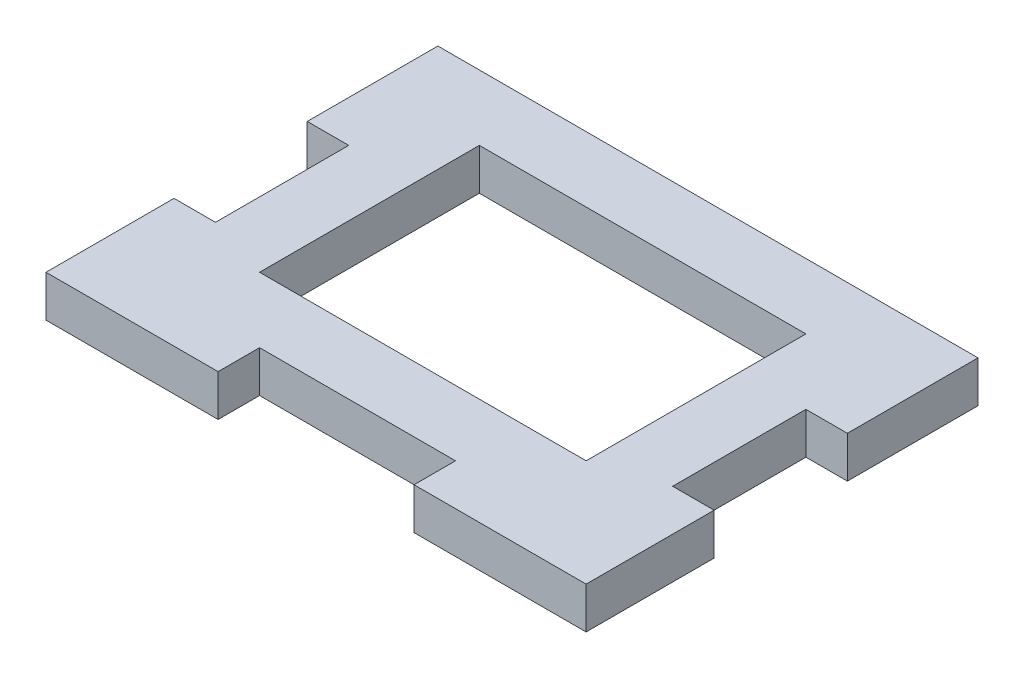
ISO-10303-21;
HEADER;
FILE_DESCRIPTION(('STEP AP214'),'2;1');
FILE_NAME('part.step','',(''),(''),'','','');
FILE_SCHEMA(('AUTOMOTIVE_DESIGN { 1 0 10303 214 1 1 1 1 }'));
ENDSEC;
DATA;
#1=APPLICATION_CONTEXT('core data for automotive mechanical design processes');
#2=APPLICATION_PROTOCOL_DEFINITION('international standard','automotive_design',2000,#1);
#3=PRODUCT_CONTEXT('',#1,'mechanical');
#4=PRODUCT('Part','Part','',(#3));
#5=PRODUCT_RELATED_PRODUCT_CATEGORY('part','',(#4));
#6=PRODUCT_DEFINITION_FORMATION('','',#4);
#7=PRODUCT_DEFINITION_CONTEXT('part definition',#1,'design');
#8=PRODUCT_DEFINITION('design','',#6,#7);
#9=PRODUCT_DEFINITION_SHAPE('','',#8);
#10=(LENGTH_UNIT() NAMED_UNIT(*) SI_UNIT(.MILLI.,.METRE.));
#11=(NAMED_UNIT(*) PLANE_ANGLE_UNIT() SI_UNIT($,.RADIAN.));
#12=(NAMED_UNIT(*) SI_UNIT($,.STERADIAN.) SOLID_ANGLE_UNIT());
#13=UNCERTAINTY_MEASURE_WITH_UNIT(LENGTH_MEASURE(1.E-05),#10,'distance_accuracy_value','');
#14=(GEOMETRIC_REPRESENTATION_CONTEXT(3) GLOBAL_UNCERTAINTY_ASSIGNED_CONTEXT((#13)) GLOBAL_UNIT_ASSIGNED_CONTEXT((#10,
#11,#12)) REPRESENTATION_CONTEXT('',''));
#15=CARTESIAN_POINT('',(0.,0.,0.));
#16=DIRECTION('',(0.,0.,1.));
#17=DIRECTION('',(1.,0.,0.));
#18=AXIS2_PLACEMENT_3D('',#15,#16,#17);
#19=CARTESIAN_POINT('',(0.,3.175,0.));
#20=DIRECTION('',(0.,0.,-1.));
#21=DIRECTION('',(-1.,0.,0.));
#22=AXIS2_PLACEMENT_3D('',#19,#20,#21);
#23=PLANE('',#22);
#24=DIRECTION('',(1.,0.,0.));
#25=VECTOR('',#24,1.);
#26=CARTESIAN_POINT('',(0.,0.,0.));
#27=LINE('',#26,#25);
#28=CARTESIAN_POINT('',(0.,0.,0.));
#29=VERTEX_POINT('',#28);
#30=CARTESIAN_POINT('',(13.175,0.,0.));
#31=VERTEX_POINT('',#30);
#32=EDGE_CURVE('E306',#29,#31,#27,.T.);
#33=ORIENTED_EDGE('',*,*,#32,.T.);
#34=DIRECTION('',(0.,-1.,0.));
#35=VECTOR('',#34,1.);
#36=CARTESIAN_POINT('',(13.175,3.175,0.));
#37=LINE('',#36,#35);
#38=CARTESIAN_POINT('',(13.175,3.175,0.));
#39=VERTEX_POINT('',#38);
#40=EDGE_CURVE('E223',#39,#31,#37,.T.);
#41=ORIENTED_EDGE('',*,*,#40,.F.);
#42=DIRECTION('',(1.,0.,0.));
#43=VECTOR('',#42,1.);
#44=CARTESIAN_POINT('',(0.,3.175,0.));
#45=LINE('',#44,#43);
#46=CARTESIAN_POINT('',(0.,3.175,0.));
#47=VERTEX_POINT('',#46);
#48=EDGE_CURVE('E292',#47,#39,#45,.T.);
#49=ORIENTED_EDGE('',*,*,#48,.F.);
#50=DIRECTION('',(0.,-1.,0.));
#51=VECTOR('',#50,1.);
#52=CARTESIAN_POINT('',(0.,3.175,0.));
#53=LINE('',#52,#51);
#54=EDGE_CURVE('E11',#47,#29,#53,.T.);
#55=ORIENTED_EDGE('',*,*,#54,.T.);
#56=EDGE_LOOP('',(#33,#41,#49,#55));
#57=FACE_BOUND('',#56,.T.);
#58=ADVANCED_FACE('F33',(#57),#23,.F.);
#59=CARTESIAN_POINT('',(41.35,3.175,0.));
#60=DIRECTION('',(-1.,0.,0.));
#61=DIRECTION('',(0.,0.,1.));
#62=AXIS2_PLACEMENT_3D('',#59,#60,#61);
#63=PLANE('',#62);
#64=DIRECTION('',(0.,0.,-1.));
#65=VECTOR('',#64,1.);
#66=CARTESIAN_POINT('',(41.35,0.,0.));
#67=LINE('',#66,#65);
#68=CARTESIAN_POINT('',(41.35,0.,0.));
#69=VERTEX_POINT('',#68);
#70=CARTESIAN_POINT('',(41.35,0.,-9.8));
#71=VERTEX_POINT('',#70);
#72=EDGE_CURVE('E310',#69,#71,#67,.T.);
#73=ORIENTED_EDGE('',*,*,#72,.T.);
#74=DIRECTION('',(0.,-1.,0.));
#75=VECTOR('',#74,1.);
#76=CARTESIAN_POINT('',(41.35,3.175,-9.8));
#77=LINE('',#76,#75);
#78=CARTESIAN_POINT('',(41.35,3.175,-9.8));
#79=VERTEX_POINT('',#78);
#80=EDGE_CURVE('E230',#79,#71,#77,.T.);
#81=ORIENTED_EDGE('',*,*,#80,.F.);
#82=DIRECTION('',(0.,0.,-1.));
#83=VECTOR('',#82,1.);
#84=CARTESIAN_POINT('',(41.35,3.175,0.));
#85=LINE('',#84,#83);
#86=CARTESIAN_POINT('',(41.35,3.175,0.));
#87=VERTEX_POINT('',#86);
#88=EDGE_CURVE('E296',#87,#79,#85,.T.);
#89=ORIENTED_EDGE('',*,*,#88,.F.);
#90=DIRECTION('',(0.,-1.,0.));
#91=VECTOR('',#90,1.);
#92=CARTESIAN_POINT('',(41.35,3.175,0.));
#93=LINE('',#92,#91);
#94=EDGE_CURVE('E41',#87,#69,#93,.T.);
#95=ORIENTED_EDGE('',*,*,#94,.T.);
#96=EDGE_LOOP('',(#73,#81,#89,#95));
#97=FACE_BOUND('',#96,.T.);
#98=ADVANCED_FACE('F324',(#97),#63,.F.);
#99=CARTESIAN_POINT('',(0.,3.175,0.));
#100=DIRECTION('',(1.,0.,0.));
#101=DIRECTION('',(0.,0.,-1.));
#102=AXIS2_PLACEMENT_3D('',#99,#100,#101);
#103=PLANE('',#102);
#104=DIRECTION('',(0.,0.,1.));
#105=VECTOR('',#104,1.);
#106=CARTESIAN_POINT('',(0.,0.,0.));
#107=LINE('',#106,#105);
#108=CARTESIAN_POINT('',(0.,0.,-30.));
#109=VERTEX_POINT('',#108);
#110=CARTESIAN_POINT('',(0.,0.,-20.));
#111=VERTEX_POINT('',#110);
#112=EDGE_CURVE('E302',#109,#111,#107,.T.);
#113=ORIENTED_EDGE('',*,*,#112,.T.);
#114=DIRECTION('',(0.,-1.,0.));
#115=VECTOR('',#114,1.);
#116=CARTESIAN_POINT('',(0.,3.175,-20.));
#117=LINE('',#116,#115);
#118=CARTESIAN_POINT('',(0.,3.175,-20.));
#119=VERTEX_POINT('',#118);
#120=EDGE_CURVE('E280',#119,#111,#117,.T.);
#121=ORIENTED_EDGE('',*,*,#120,.F.);
#122=DIRECTION('',(0.,0.,1.));
#123=VECTOR('',#122,1.);
#124=CARTESIAN_POINT('',(0.,3.175,0.));
#125=LINE('',#124,#123);
#126=CARTESIAN_POINT('',(0.,3.175,-30.));
#127=VERTEX_POINT('',#126);
#128=EDGE_CURVE('E287',#127,#119,#125,.T.);
#129=ORIENTED_EDGE('',*,*,#128,.F.);
#130=DIRECTION('',(0.,-1.,0.));
#131=VECTOR('',#130,1.);
#132=CARTESIAN_POINT('',(0.,3.175,-30.));
#133=LINE('',#132,#131);
#134=EDGE_CURVE('E301',#127,#109,#133,.T.);
#135=ORIENTED_EDGE('',*,*,#134,.T.);
#136=EDGE_LOOP('',(#113,#121,#129,#135));
#137=FACE_BOUND('',#136,.T.);
#138=ADVANCED_FACE('F372',(#137),#103,.F.);
#139=CARTESIAN_POINT('',(0.,3.175,-9.8));
#140=VERTEX_POINT('',#139);
#141=EDGE_CURVE('E291',#140,#47,#125,.T.);
#142=ORIENTED_EDGE('',*,*,#141,.F.);
#143=DIRECTION('',(0.,-1.,0.));
#144=VECTOR('',#143,1.);
#145=CARTESIAN_POINT('',(0.,3.175,-9.8));
#146=LINE('',#145,#144);
#147=CARTESIAN_POINT('',(0.,0.,-9.8));
#148=VERTEX_POINT('',#147);
#149=EDGE_CURVE('E282',#140,#148,#146,.T.);
#150=ORIENTED_EDGE('',*,*,#149,.T.);
#151=EDGE_CURVE('E279',#148,#29,#107,.T.);
#152=ORIENTED_EDGE('',*,*,#151,.T.);
#153=ORIENTED_EDGE('',*,*,#54,.F.);
#154=EDGE_LOOP('',(#142,#150,#152,#153));
#155=FACE_BOUND('',#154,.T.);
#156=ADVANCED_FACE('F35',(#155),#103,.F.);
#157=CARTESIAN_POINT('',(28.175,3.175,0.));
#158=VERTEX_POINT('',#157);
#159=EDGE_CURVE('E290',#158,#87,#45,.T.);
#160=ORIENTED_EDGE('',*,*,#159,.F.);
#161=DIRECTION('',(0.,-1.,0.));
#162=VECTOR('',#161,1.);
#163=CARTESIAN_POINT('',(28.175,3.175,0.));
#164=LINE('',#163,#162);
#165=CARTESIAN_POINT('',(28.175,0.,0.));
#166=VERTEX_POINT('',#165);
#167=EDGE_CURVE('E254',#158,#166,#164,.T.);
#168=ORIENTED_EDGE('',*,*,#167,.T.);
#169=EDGE_CURVE('E305',#166,#69,#27,.T.);
#170=ORIENTED_EDGE('',*,*,#169,.T.);
#171=ORIENTED_EDGE('',*,*,#94,.F.);
#172=EDGE_LOOP('',(#160,#168,#170,#171));
#173=FACE_BOUND('',#172,.T.);
#174=ADVANCED_FACE('F339',(#173),#23,.F.);
#175=CARTESIAN_POINT('',(41.35,3.175,-20.));
#176=VERTEX_POINT('',#175);
#177=CARTESIAN_POINT('',(41.35,3.175,-30.));
#178=VERTEX_POINT('',#177);
#179=EDGE_CURVE('E295',#176,#178,#85,.T.);
#180=ORIENTED_EDGE('',*,*,#179,.F.);
#181=DIRECTION('',(0.,-1.,0.));
#182=VECTOR('',#181,1.);
#183=CARTESIAN_POINT('',(41.35,3.175,-20.));
#184=LINE('',#183,#182);
#185=CARTESIAN_POINT('',(41.35,0.,-20.));
#186=VERTEX_POINT('',#185);
#187=EDGE_CURVE('E232',#176,#186,#184,.T.);
#188=ORIENTED_EDGE('',*,*,#187,.T.);
#189=CARTESIAN_POINT('',(41.35,0.,-30.));
#190=VERTEX_POINT('',#189);
#191=EDGE_CURVE('E309',#186,#190,#67,.T.);
#192=ORIENTED_EDGE('',*,*,#191,.T.);
#193=DIRECTION('',(0.,-1.,0.));
#194=VECTOR('',#193,1.);
#195=CARTESIAN_POINT('',(41.35,3.175,-30.));
#196=LINE('',#195,#194);
#197=EDGE_CURVE('E317',#178,#190,#196,.T.);
#198=ORIENTED_EDGE('',*,*,#197,.F.);
#199=EDGE_LOOP('',(#180,#188,#192,#198));
#200=FACE_BOUND('',#199,.T.);
#201=ADVANCED_FACE('F382',(#200),#63,.F.);
#202=CARTESIAN_POINT('',(0.,3.175,-30.));
#203=DIRECTION('',(0.,0.,1.));
#204=DIRECTION('',(1.,0.,0.));
#205=AXIS2_PLACEMENT_3D('',#202,#203,#204);
#206=PLANE('',#205);
#207=DIRECTION('',(-1.,0.,0.));
#208=VECTOR('',#207,1.);
#209=CARTESIAN_POINT('',(0.,0.,-30.));
#210=LINE('',#209,#208);
#211=EDGE_CURVE('E313',#190,#109,#210,.T.);
#212=ORIENTED_EDGE('',*,*,#211,.T.);
#213=ORIENTED_EDGE('',*,*,#134,.F.);
#214=DIRECTION('',(-1.,0.,0.));
#215=VECTOR('',#214,1.);
#216=CARTESIAN_POINT('',(0.,3.175,-30.));
#217=LINE('',#216,#215);
#218=EDGE_CURVE('E299',#178,#127,#217,.T.);
#219=ORIENTED_EDGE('',*,*,#218,.F.);
#220=ORIENTED_EDGE('',*,*,#197,.T.);
#221=EDGE_LOOP('',(#212,#213,#219,#220));
#222=FACE_BOUND('',#221,.T.);
#223=ADVANCED_FACE('F377',(#222),#206,.F.);
#224=CARTESIAN_POINT('',(0.,3.175,0.));
#225=DIRECTION('',(0.,-1.,0.));
#226=DIRECTION('',(0.,0.,-1.));
#227=AXIS2_PLACEMENT_3D('',#224,#225,#226);
#228=PLANE('',#227);
#229=DIRECTION('',(0.,0.,1.));
#230=VECTOR('',#229,1.);
#231=CARTESIAN_POINT('',(33.1750000000001,3.175,2.32592136074656E-13));
#232=LINE('',#231,#230);
#233=CARTESIAN_POINT('',(33.1750000000002,3.175,-25.));
#234=VERTEX_POINT('',#233);
#235=CARTESIAN_POINT('',(33.1750000000001,3.175,-8.175));
#236=VERTEX_POINT('',#235);
#237=EDGE_CURVE('E195',#234,#236,#232,.T.);
#238=ORIENTED_EDGE('',*,*,#237,.T.);
#239=DIRECTION('',(-1.,0.,0.));
#240=VECTOR('',#239,1.);
#241=CARTESIAN_POINT('',(0.,3.175,-8.175));
#242=LINE('',#241,#240);
#243=CARTESIAN_POINT('',(8.17500000000012,3.175,-8.175));
#244=VERTEX_POINT('',#243);
#245=EDGE_CURVE('E176',#236,#244,#242,.T.);
#246=ORIENTED_EDGE('',*,*,#245,.T.);
#247=DIRECTION('',(0.,0.,-1.));
#248=VECTOR('',#247,1.);
#249=CARTESIAN_POINT('',(8.17500000000006,3.175,0.));
#250=LINE('',#249,#248);
#251=CARTESIAN_POINT('',(8.17500000000024,3.175,-25.));
#252=VERTEX_POINT('',#251);
#253=EDGE_CURVE('E204',#244,#252,#250,.T.);
#254=ORIENTED_EDGE('',*,*,#253,.T.);
#255=DIRECTION('',(1.,0.,0.));
#256=VECTOR('',#255,1.);
#257=CARTESIAN_POINT('',(0.,3.175,-25.));
#258=LINE('',#257,#256);
#259=EDGE_CURVE('E201',#252,#234,#258,.T.);
#260=ORIENTED_EDGE('',*,*,#259,.T.);
#261=EDGE_LOOP('',(#238,#246,#254,#260));
#262=FACE_BOUND('',#261,.T.);
#263=ORIENTED_EDGE('',*,*,#88,.T.);
#264=DIRECTION('',(-1.,0.,0.));
#265=VECTOR('',#264,1.);
#266=CARTESIAN_POINT('',(38.1750000000002,3.175,-9.79999999999999));
#267=LINE('',#266,#265);
#268=CARTESIAN_POINT('',(38.1750000000002,3.175,-9.79999999999999));
#269=VERTEX_POINT('',#268);
#270=EDGE_CURVE('E216',#79,#269,#267,.T.);
#271=ORIENTED_EDGE('',*,*,#270,.T.);
#272=DIRECTION('',(0.,0.,-1.));
#273=VECTOR('',#272,1.);
#274=CARTESIAN_POINT('',(38.1750000000002,3.175,-9.79999999999999));
#275=LINE('',#274,#273);
#276=CARTESIAN_POINT('',(38.1750000000002,3.175,-20.));
#277=VERTEX_POINT('',#276);
#278=EDGE_CURVE('E209',#269,#277,#275,.T.);
#279=ORIENTED_EDGE('',*,*,#278,.T.);
#280=DIRECTION('',(1.,0.,0.));
#281=VECTOR('',#280,1.);
#282=CARTESIAN_POINT('',(38.1750000000002,3.175,-20.));
#283=LINE('',#282,#281);
#284=EDGE_CURVE('E212',#277,#176,#283,.T.);
#285=ORIENTED_EDGE('',*,*,#284,.T.);
#286=ORIENTED_EDGE('',*,*,#179,.T.);
#287=ORIENTED_EDGE('',*,*,#218,.T.);
#288=ORIENTED_EDGE('',*,*,#128,.T.);
#289=DIRECTION('',(1.,0.,0.));
#290=VECTOR('',#289,1.);
#291=CARTESIAN_POINT('',(3.17500000000024,3.175,-20.));
#292=LINE('',#291,#290);
#293=CARTESIAN_POINT('',(3.17500000000024,3.175,-20.));
#294=VERTEX_POINT('',#293);
#295=EDGE_CURVE('E268',#119,#294,#292,.T.);
#296=ORIENTED_EDGE('',*,*,#295,.T.);
#297=DIRECTION('',(0.,0.,1.));
#298=VECTOR('',#297,1.);
#299=CARTESIAN_POINT('',(3.17500000000024,3.175,-20.));
#300=LINE('',#299,#298);
#301=CARTESIAN_POINT('',(3.17500000000024,3.175,-9.8));
#302=VERTEX_POINT('',#301);
#303=EDGE_CURVE('E261',#294,#302,#300,.T.);
#304=ORIENTED_EDGE('',*,*,#303,.T.);
#305=DIRECTION('',(-1.,0.,0.));
#306=VECTOR('',#305,1.);
#307=CARTESIAN_POINT('',(3.17500000000024,3.175,-9.8));
#308=LINE('',#307,#306);
#309=EDGE_CURVE('E264',#302,#140,#308,.T.);
#310=ORIENTED_EDGE('',*,*,#309,.T.);
#311=ORIENTED_EDGE('',*,*,#141,.T.);
#312=ORIENTED_EDGE('',*,*,#48,.T.);
#313=DIRECTION('',(0.,0.,-1.));
#314=VECTOR('',#313,1.);
#315=CARTESIAN_POINT('',(13.175,3.175,-3.175));
#316=LINE('',#315,#314);
#317=CARTESIAN_POINT('',(13.175,3.175,-3.175));
#318=VERTEX_POINT('',#317);
#319=EDGE_CURVE('E237',#39,#318,#316,.T.);
#320=ORIENTED_EDGE('',*,*,#319,.T.);
#321=DIRECTION('',(1.,0.,0.));
#322=VECTOR('',#321,1.);
#323=CARTESIAN_POINT('',(13.175,3.175,-3.175));
#324=LINE('',#323,#322);
#325=CARTESIAN_POINT('',(28.175,3.175,-3.175));
#326=VERTEX_POINT('',#325);
#327=EDGE_CURVE('E240',#318,#326,#324,.T.);
#328=ORIENTED_EDGE('',*,*,#327,.T.);
#329=DIRECTION('',(0.,0.,1.));
#330=VECTOR('',#329,1.);
#331=CARTESIAN_POINT('',(28.175,3.175,-3.175));
#332=LINE('',#331,#330);
#333=EDGE_CURVE('E244',#326,#158,#332,.T.);
#334=ORIENTED_EDGE('',*,*,#333,.T.);
#335=ORIENTED_EDGE('',*,*,#159,.T.);
#336=EDGE_LOOP('',(#263,#271,#279,#285,#286,#287,#288,#296,#304,#310,#311,#312,#320,#328,#334,#335));
#337=FACE_BOUND('',#336,.T.);
#338=ADVANCED_FACE('F337',(#262,#337),#228,.F.);
#339=CARTESIAN_POINT('',(0.,0.,0.));
#340=DIRECTION('',(0.,-1.,0.));
#341=DIRECTION('',(0.,0.,-1.));
#342=AXIS2_PLACEMENT_3D('',#339,#340,#341);
#343=PLANE('',#342);
#344=DIRECTION('',(1.,0.,0.));
#345=VECTOR('',#344,1.);
#346=CARTESIAN_POINT('',(8.17500000000012,0.,-8.175));
#347=LINE('',#346,#345);
#348=CARTESIAN_POINT('',(8.17500000000012,0.,-8.175));
#349=VERTEX_POINT('',#348);
#350=CARTESIAN_POINT('',(33.1750000000001,0.,-8.175));
#351=VERTEX_POINT('',#350);
#352=EDGE_CURVE('E173',#349,#351,#347,.T.);
#353=ORIENTED_EDGE('',*,*,#352,.T.);
#354=DIRECTION('',(0.,0.,-1.));
#355=VECTOR('',#354,1.);
#356=CARTESIAN_POINT('',(33.1750000000001,0.,-8.175));
#357=LINE('',#356,#355);
#358=CARTESIAN_POINT('',(33.1750000000002,0.,-25.));
#359=VERTEX_POINT('',#358);
#360=EDGE_CURVE('E182',#351,#359,#357,.T.);
#361=ORIENTED_EDGE('',*,*,#360,.T.);
#362=DIRECTION('',(-1.,0.,0.));
#363=VECTOR('',#362,1.);
#364=CARTESIAN_POINT('',(33.1750000000002,0.,-25.));
#365=LINE('',#364,#363);
#366=CARTESIAN_POINT('',(8.17500000000024,0.,-25.));
#367=VERTEX_POINT('',#366);
#368=EDGE_CURVE('E56',#359,#367,#365,.T.);
#369=ORIENTED_EDGE('',*,*,#368,.T.);
#370=DIRECTION('',(0.,0.,1.));
#371=VECTOR('',#370,1.);
#372=CARTESIAN_POINT('',(8.17500000000024,0.,-25.));
#373=LINE('',#372,#371);
#374=EDGE_CURVE('E179',#367,#349,#373,.T.);
#375=ORIENTED_EDGE('',*,*,#374,.T.);
#376=EDGE_LOOP('',(#353,#361,#369,#375));
#377=FACE_BOUND('',#376,.T.);
#378=DIRECTION('',(-1.,0.,0.));
#379=VECTOR('',#378,1.);
#380=CARTESIAN_POINT('',(38.1750000000002,0.,-9.79999999999999));
#381=LINE('',#380,#379);
#382=CARTESIAN_POINT('',(38.1750000000002,0.,-9.79999999999999));
#383=VERTEX_POINT('',#382);
#384=EDGE_CURVE('E213',#71,#383,#381,.T.);
#385=ORIENTED_EDGE('',*,*,#384,.F.);
#386=ORIENTED_EDGE('',*,*,#72,.F.);
#387=ORIENTED_EDGE('',*,*,#169,.F.);
#388=DIRECTION('',(0.,0.,1.));
#389=VECTOR('',#388,1.);
#390=CARTESIAN_POINT('',(28.175,0.,-3.175));
#391=LINE('',#390,#389);
#392=CARTESIAN_POINT('',(28.175,0.,-3.175));
#393=VERTEX_POINT('',#392);
#394=EDGE_CURVE('E241',#393,#166,#391,.T.);
#395=ORIENTED_EDGE('',*,*,#394,.F.);
#396=DIRECTION('',(1.,0.,0.));
#397=VECTOR('',#396,1.);
#398=CARTESIAN_POINT('',(13.175,0.,-3.175));
#399=LINE('',#398,#397);
#400=CARTESIAN_POINT('',(13.175,0.,-3.175));
#401=VERTEX_POINT('',#400);
#402=EDGE_CURVE('E249',#401,#393,#399,.T.);
#403=ORIENTED_EDGE('',*,*,#402,.F.);
#404=DIRECTION('',(0.,0.,-1.));
#405=VECTOR('',#404,1.);
#406=CARTESIAN_POINT('',(13.175,0.,-3.175));
#407=LINE('',#406,#405);
#408=EDGE_CURVE('E208',#31,#401,#407,.T.);
#409=ORIENTED_EDGE('',*,*,#408,.F.);
#410=ORIENTED_EDGE('',*,*,#32,.F.);
#411=ORIENTED_EDGE('',*,*,#151,.F.);
#412=DIRECTION('',(-1.,0.,0.));
#413=VECTOR('',#412,1.);
#414=CARTESIAN_POINT('',(3.17500000000024,0.,-9.8));
#415=LINE('',#414,#413);
#416=CARTESIAN_POINT('',(3.17500000000024,0.,-9.8));
#417=VERTEX_POINT('',#416);
#418=EDGE_CURVE('E273',#417,#148,#415,.T.);
#419=ORIENTED_EDGE('',*,*,#418,.F.);
#420=DIRECTION('',(0.,0.,1.));
#421=VECTOR('',#420,1.);
#422=CARTESIAN_POINT('',(3.17500000000024,0.,-20.));
#423=LINE('',#422,#421);
#424=CARTESIAN_POINT('',(3.17500000000024,0.,-20.));
#425=VERTEX_POINT('',#424);
#426=EDGE_CURVE('E229',#425,#417,#423,.T.);
#427=ORIENTED_EDGE('',*,*,#426,.F.);
#428=DIRECTION('',(1.,0.,0.));
#429=VECTOR('',#428,1.);
#430=CARTESIAN_POINT('',(3.17500000000024,0.,-20.));
#431=LINE('',#430,#429);
#432=EDGE_CURVE('E265',#111,#425,#431,.T.);
#433=ORIENTED_EDGE('',*,*,#432,.F.);
#434=ORIENTED_EDGE('',*,*,#112,.F.);
#435=ORIENTED_EDGE('',*,*,#211,.F.);
#436=ORIENTED_EDGE('',*,*,#191,.F.);
#437=DIRECTION('',(1.,0.,0.));
#438=VECTOR('',#437,1.);
#439=CARTESIAN_POINT('',(38.1750000000002,0.,-20.));
#440=LINE('',#439,#438);
#441=CARTESIAN_POINT('',(38.1750000000002,0.,-20.));
#442=VERTEX_POINT('',#441);
#443=EDGE_CURVE('E222',#442,#186,#440,.T.);
#444=ORIENTED_EDGE('',*,*,#443,.F.);
#445=DIRECTION('',(0.,0.,-1.));
#446=VECTOR('',#445,1.);
#447=CARTESIAN_POINT('',(38.1750000000002,0.,-9.79999999999999));
#448=LINE('',#447,#446);
#449=EDGE_CURVE('E220',#383,#442,#448,.T.);
#450=ORIENTED_EDGE('',*,*,#449,.F.);
#451=EDGE_LOOP('',(#385,#386,#387,#395,#403,#409,#410,#411,#419,#427,#433,#434,#435,#436,#444,#450));
#452=FACE_BOUND('',#451,.T.);
#453=ADVANCED_FACE('F186',(#377,#452),#343,.T.);
#454=CARTESIAN_POINT('',(3.17500000000024,3.175,-20.));
#455=DIRECTION('',(1.,0.,0.));
#456=DIRECTION('',(0.,0.,-1.));
#457=AXIS2_PLACEMENT_3D('',#454,#455,#456);
#458=PLANE('',#457);
#459=ORIENTED_EDGE('',*,*,#426,.T.);
#460=DIRECTION('',(0.,-1.,0.));
#461=VECTOR('',#460,1.);
#462=CARTESIAN_POINT('',(3.17500000000024,3.175,-9.8));
#463=LINE('',#462,#461);
#464=EDGE_CURVE('E271',#302,#417,#463,.T.);
#465=ORIENTED_EDGE('',*,*,#464,.F.);
#466=ORIENTED_EDGE('',*,*,#303,.F.);
#467=DIRECTION('',(0.,-1.,0.));
#468=VECTOR('',#467,1.);
#469=CARTESIAN_POINT('',(3.17500000000024,3.175,-20.));
#470=LINE('',#469,#468);
#471=EDGE_CURVE('E277',#294,#425,#470,.T.);
#472=ORIENTED_EDGE('',*,*,#471,.T.);
#473=EDGE_LOOP('',(#459,#465,#466,#472));
#474=FACE_BOUND('',#473,.T.);
#475=ADVANCED_FACE('F365',(#474),#458,.F.);
#476=CARTESIAN_POINT('',(3.17500000000024,3.175,-20.));
#477=DIRECTION('',(0.,0.,-1.));
#478=DIRECTION('',(-1.,0.,0.));
#479=AXIS2_PLACEMENT_3D('',#476,#477,#478);
#480=PLANE('',#479);
#481=ORIENTED_EDGE('',*,*,#432,.T.);
#482=ORIENTED_EDGE('',*,*,#471,.F.);
#483=ORIENTED_EDGE('',*,*,#295,.F.);
#484=ORIENTED_EDGE('',*,*,#120,.T.);
#485=EDGE_LOOP('',(#481,#482,#483,#484));
#486=FACE_BOUND('',#485,.T.);
#487=ADVANCED_FACE('F367',(#486),#480,.F.);
#488=CARTESIAN_POINT('',(3.17500000000024,3.175,-9.8));
#489=DIRECTION('',(0.,0.,1.));
#490=DIRECTION('',(1.,0.,0.));
#491=AXIS2_PLACEMENT_3D('',#488,#489,#490);
#492=PLANE('',#491);
#493=ORIENTED_EDGE('',*,*,#418,.T.);
#494=ORIENTED_EDGE('',*,*,#149,.F.);
#495=ORIENTED_EDGE('',*,*,#309,.F.);
#496=ORIENTED_EDGE('',*,*,#464,.T.);
#497=EDGE_LOOP('',(#493,#494,#495,#496));
#498=FACE_BOUND('',#497,.T.);
#499=ADVANCED_FACE('F362',(#498),#492,.F.);
#500=CARTESIAN_POINT('',(13.175,3.175,-3.175));
#501=DIRECTION('',(-1.,0.,0.));
#502=DIRECTION('',(0.,0.,1.));
#503=AXIS2_PLACEMENT_3D('',#500,#501,#502);
#504=PLANE('',#503);
#505=ORIENTED_EDGE('',*,*,#408,.T.);
#506=DIRECTION('',(0.,-1.,0.));
#507=VECTOR('',#506,1.);
#508=CARTESIAN_POINT('',(13.175,3.175,-3.175));
#509=LINE('',#508,#507);
#510=EDGE_CURVE('E247',#318,#401,#509,.T.);
#511=ORIENTED_EDGE('',*,*,#510,.F.);
#512=ORIENTED_EDGE('',*,*,#319,.F.);
#513=ORIENTED_EDGE('',*,*,#40,.T.);
#514=EDGE_LOOP('',(#505,#511,#512,#513));
#515=FACE_BOUND('',#514,.T.);
#516=ADVANCED_FACE('F349',(#515),#504,.F.);
#517=CARTESIAN_POINT('',(28.175,3.175,-3.175));
#518=DIRECTION('',(1.,0.,0.));
#519=DIRECTION('',(0.,0.,-1.));
#520=AXIS2_PLACEMENT_3D('',#517,#518,#519);
#521=PLANE('',#520);
#522=ORIENTED_EDGE('',*,*,#394,.T.);
#523=ORIENTED_EDGE('',*,*,#167,.F.);
#524=ORIENTED_EDGE('',*,*,#333,.F.);
#525=DIRECTION('',(0.,-1.,0.));
#526=VECTOR('',#525,1.);
#527=CARTESIAN_POINT('',(28.175,3.175,-3.175));
#528=LINE('',#527,#526);
#529=EDGE_CURVE('E257',#326,#393,#528,.T.);
#530=ORIENTED_EDGE('',*,*,#529,.T.);
#531=EDGE_LOOP('',(#522,#523,#524,#530));
#532=FACE_BOUND('',#531,.T.);
#533=ADVANCED_FACE('F341',(#532),#521,.F.);
#534=CARTESIAN_POINT('',(13.175,3.175,-3.175));
#535=DIRECTION('',(0.,0.,-1.));
#536=DIRECTION('',(-1.,0.,0.));
#537=AXIS2_PLACEMENT_3D('',#534,#535,#536);
#538=PLANE('',#537);
#539=ORIENTED_EDGE('',*,*,#402,.T.);
#540=ORIENTED_EDGE('',*,*,#529,.F.);
#541=ORIENTED_EDGE('',*,*,#327,.F.);
#542=ORIENTED_EDGE('',*,*,#510,.T.);
#543=EDGE_LOOP('',(#539,#540,#541,#542));
#544=FACE_BOUND('',#543,.T.);
#545=ADVANCED_FACE('F346',(#544),#538,.F.);
#546=CARTESIAN_POINT('',(38.1750000000002,3.175,-9.79999999999999));
#547=DIRECTION('',(-1.,0.,0.));
#548=DIRECTION('',(0.,0.,1.));
#549=AXIS2_PLACEMENT_3D('',#546,#547,#548);
#550=PLANE('',#549);
#551=ORIENTED_EDGE('',*,*,#449,.T.);
#552=DIRECTION('',(0.,-1.,0.));
#553=VECTOR('',#552,1.);
#554=CARTESIAN_POINT('',(38.1750000000002,3.175,-20.));
#555=LINE('',#554,#553);
#556=EDGE_CURVE('E219',#277,#442,#555,.T.);
#557=ORIENTED_EDGE('',*,*,#556,.F.);
#558=ORIENTED_EDGE('',*,*,#278,.F.);
#559=DIRECTION('',(0.,-1.,0.));
#560=VECTOR('',#559,1.);
#561=CARTESIAN_POINT('',(38.1750000000002,3.175,-9.79999999999999));
#562=LINE('',#561,#560);
#563=EDGE_CURVE('E227',#269,#383,#562,.T.);
#564=ORIENTED_EDGE('',*,*,#563,.T.);
#565=EDGE_LOOP('',(#551,#557,#558,#564));
#566=FACE_BOUND('',#565,.T.);
#567=ADVANCED_FACE('F387',(#566),#550,.F.);
#568=CARTESIAN_POINT('',(38.1750000000002,3.175,-9.79999999999999));
#569=DIRECTION('',(0.,0.,1.));
#570=DIRECTION('',(1.,0.,0.));
#571=AXIS2_PLACEMENT_3D('',#568,#569,#570);
#572=PLANE('',#571);
#573=ORIENTED_EDGE('',*,*,#384,.T.);
#574=ORIENTED_EDGE('',*,*,#563,.F.);
#575=ORIENTED_EDGE('',*,*,#270,.F.);
#576=ORIENTED_EDGE('',*,*,#80,.T.);
#577=EDGE_LOOP('',(#573,#574,#575,#576));
#578=FACE_BOUND('',#577,.T.);
#579=ADVANCED_FACE('F334',(#578),#572,.F.);
#580=CARTESIAN_POINT('',(38.1750000000002,3.175,-20.));
#581=DIRECTION('',(0.,0.,-1.));
#582=DIRECTION('',(-1.,0.,0.));
#583=AXIS2_PLACEMENT_3D('',#580,#581,#582);
#584=PLANE('',#583);
#585=ORIENTED_EDGE('',*,*,#443,.T.);
#586=ORIENTED_EDGE('',*,*,#187,.F.);
#587=ORIENTED_EDGE('',*,*,#284,.F.);
#588=ORIENTED_EDGE('',*,*,#556,.T.);
#589=EDGE_LOOP('',(#585,#586,#587,#588));
#590=FACE_BOUND('',#589,.T.);
#591=ADVANCED_FACE('F385',(#590),#584,.F.);
#592=CARTESIAN_POINT('',(8.17500000000012,0.,-8.175));
#593=DIRECTION('',(0.,0.,1.));
#594=DIRECTION('',(1.,0.,0.));
#595=AXIS2_PLACEMENT_3D('',#592,#593,#594);
#596=PLANE('',#595);
#597=DIRECTION('',(0.,1.,0.));
#598=VECTOR('',#597,1.);
#599=CARTESIAN_POINT('',(33.1750000000001,0.,-8.175));
#600=LINE('',#599,#598);
#601=EDGE_CURVE('E48',#351,#236,#600,.T.);
#602=ORIENTED_EDGE('',*,*,#601,.F.);
#603=ORIENTED_EDGE('',*,*,#352,.F.);
#604=DIRECTION('',(0.,1.,0.));
#605=VECTOR('',#604,1.);
#606=CARTESIAN_POINT('',(8.17500000000012,0.,-8.175));
#607=LINE('',#606,#605);
#608=EDGE_CURVE('E193',#349,#244,#607,.T.);
#609=ORIENTED_EDGE('',*,*,#608,.T.);
#610=ORIENTED_EDGE('',*,*,#245,.F.);
#611=EDGE_LOOP('',(#602,#603,#609,#610));
#612=FACE_BOUND('',#611,.T.);
#613=ADVANCED_FACE('F170',(#612),#596,.F.);
#614=CARTESIAN_POINT('',(8.17500000000024,0.,-25.));
#615=DIRECTION('',(-1.,0.,0.));
#616=DIRECTION('',(0.,0.,1.));
#617=AXIS2_PLACEMENT_3D('',#614,#615,#616);
#618=PLANE('',#617);
#619=ORIENTED_EDGE('',*,*,#608,.F.);
#620=ORIENTED_EDGE('',*,*,#374,.F.);
#621=DIRECTION('',(0.,1.,0.));
#622=VECTOR('',#621,1.);
#623=CARTESIAN_POINT('',(8.17500000000024,0.,-25.));
#624=LINE('',#623,#622);
#625=EDGE_CURVE('E196',#367,#252,#624,.T.);
#626=ORIENTED_EDGE('',*,*,#625,.T.);
#627=ORIENTED_EDGE('',*,*,#253,.F.);
#628=EDGE_LOOP('',(#619,#620,#626,#627));
#629=FACE_BOUND('',#628,.T.);
#630=ADVANCED_FACE('F506',(#629),#618,.F.);
#631=CARTESIAN_POINT('',(33.1750000000002,0.,-25.));
#632=DIRECTION('',(0.,0.,-1.));
#633=DIRECTION('',(-1.,0.,0.));
#634=AXIS2_PLACEMENT_3D('',#631,#632,#633);
#635=PLANE('',#634);
#636=ORIENTED_EDGE('',*,*,#625,.F.);
#637=ORIENTED_EDGE('',*,*,#368,.F.);
#638=DIRECTION('',(0.,1.,0.));
#639=VECTOR('',#638,1.);
#640=CARTESIAN_POINT('',(33.1750000000002,0.,-25.));
#641=LINE('',#640,#639);
#642=EDGE_CURVE('E178',#359,#234,#641,.T.);
#643=ORIENTED_EDGE('',*,*,#642,.T.);
#644=ORIENTED_EDGE('',*,*,#259,.F.);
#645=EDGE_LOOP('',(#636,#637,#643,#644));
#646=FACE_BOUND('',#645,.T.);
#647=ADVANCED_FACE('F512',(#646),#635,.F.);
#648=CARTESIAN_POINT('',(33.1750000000001,0.,-8.175));
#649=DIRECTION('',(1.,0.,0.));
#650=DIRECTION('',(0.,0.,-1.));
#651=AXIS2_PLACEMENT_3D('',#648,#649,#650);
#652=PLANE('',#651);
#653=ORIENTED_EDGE('',*,*,#642,.F.);
#654=ORIENTED_EDGE('',*,*,#360,.F.);
#655=ORIENTED_EDGE('',*,*,#601,.T.);
#656=ORIENTED_EDGE('',*,*,#237,.F.);
#657=EDGE_LOOP('',(#653,#654,#655,#656));
#658=FACE_BOUND('',#657,.T.);
#659=ADVANCED_FACE('F183',(#658),#652,.F.);
#660=CLOSED_SHELL('',(#58,#98,#138,#156,#174,#201,#223,#338,#453,#475,#487,#499,#516,#533,#545,
#567,#579,#591,#613,#630,#647,#659));
#661=MANIFOLD_SOLID_BREP('B2',#660);
#662=ADVANCED_BREP_SHAPE_REPRESENTATION('',(#18,#661),#14);
#663=SHAPE_DEFINITION_REPRESENTATION(#9,#662);
ENDSEC;
END-ISO-10303-21;
